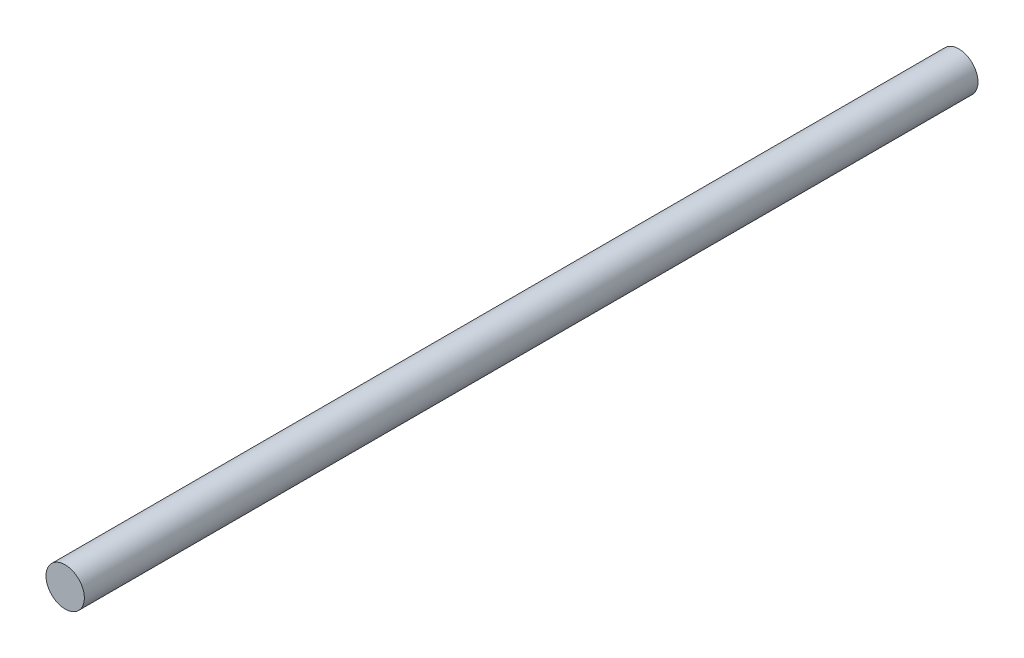
ISO-10303-21;
HEADER;
FILE_DESCRIPTION(('STEP AP214'),'2;1');
FILE_NAME('part.step','',(''),(''),'','','');
FILE_SCHEMA(('AUTOMOTIVE_DESIGN { 1 0 10303 214 1 1 1 1 }'));
ENDSEC;
DATA;
#1=APPLICATION_CONTEXT('core data for automotive mechanical design processes');
#2=APPLICATION_PROTOCOL_DEFINITION('international standard','automotive_design',2000,#1);
#3=PRODUCT_CONTEXT('',#1,'mechanical');
#4=PRODUCT('Part','Part','',(#3));
#5=PRODUCT_RELATED_PRODUCT_CATEGORY('part','',(#4));
#6=PRODUCT_DEFINITION_FORMATION('','',#4);
#7=PRODUCT_DEFINITION_CONTEXT('part definition',#1,'design');
#8=PRODUCT_DEFINITION('design','',#6,#7);
#9=PRODUCT_DEFINITION_SHAPE('','',#8);
#10=(LENGTH_UNIT() NAMED_UNIT(*) SI_UNIT(.MILLI.,.METRE.));
#11=(NAMED_UNIT(*) PLANE_ANGLE_UNIT() SI_UNIT($,.RADIAN.));
#12=(NAMED_UNIT(*) SI_UNIT($,.STERADIAN.) SOLID_ANGLE_UNIT());
#13=UNCERTAINTY_MEASURE_WITH_UNIT(LENGTH_MEASURE(1.E-05),#10,'distance_accuracy_value','');
#14=(GEOMETRIC_REPRESENTATION_CONTEXT(3) GLOBAL_UNCERTAINTY_ASSIGNED_CONTEXT((#13)) GLOBAL_UNIT_ASSIGNED_CONTEXT((#10,
#11,#12)) REPRESENTATION_CONTEXT('',''));
#15=CARTESIAN_POINT('',(0.,0.,0.));
#16=DIRECTION('',(0.,0.,1.));
#17=DIRECTION('',(1.,0.,0.));
#18=AXIS2_PLACEMENT_3D('',#15,#16,#17);
#19=CARTESIAN_POINT('',(0.,0.,500.5));
#20=DIRECTION('',(0.,0.,-1.));
#21=DIRECTION('',(-1.,0.,0.));
#22=AXIS2_PLACEMENT_3D('',#19,#20,#21);
#23=CYLINDRICAL_SURFACE('',#22,10.75);
#24=CARTESIAN_POINT('',(0.,0.,500.5));
#25=DIRECTION('',(0.,0.,1.));
#26=DIRECTION('',(1.,0.,0.));
#27=AXIS2_PLACEMENT_3D('',#24,#25,#26);
#28=CIRCLE('',#27,10.75);
#29=CARTESIAN_POINT('',(10.75,0.,500.5));
#30=VERTEX_POINT('',#29);
#31=EDGE_CURVE('E10',#30,#30,#28,.T.);
#32=ORIENTED_EDGE('',*,*,#31,.F.);
#33=EDGE_LOOP('',(#32));
#34=FACE_BOUND('',#33,.T.);
#35=CARTESIAN_POINT('',(0.,0.,0.));
#36=DIRECTION('',(0.,0.,1.));
#37=DIRECTION('',(1.,0.,0.));
#38=AXIS2_PLACEMENT_3D('',#35,#36,#37);
#39=CIRCLE('',#38,10.75);
#40=CARTESIAN_POINT('',(10.75,0.,0.));
#41=VERTEX_POINT('',#40);
#42=EDGE_CURVE('E35',#41,#41,#39,.T.);
#43=ORIENTED_EDGE('',*,*,#42,.T.);
#44=EDGE_LOOP('',(#43));
#45=FACE_BOUND('',#44,.T.);
#46=ADVANCED_FACE('F32',(#34,#45),#23,.T.);
#47=CARTESIAN_POINT('',(0.,0.,500.5));
#48=DIRECTION('',(0.,0.,1.));
#49=DIRECTION('',(1.,0.,0.));
#50=AXIS2_PLACEMENT_3D('',#47,#48,#49);
#51=PLANE('',#50);
#52=ORIENTED_EDGE('',*,*,#31,.T.);
#53=EDGE_LOOP('',(#52));
#54=FACE_BOUND('',#53,.T.);
#55=ADVANCED_FACE('F47',(#54),#51,.T.);
#56=CARTESIAN_POINT('',(0.,0.,0.));
#57=DIRECTION('',(0.,0.,1.));
#58=DIRECTION('',(1.,0.,0.));
#59=AXIS2_PLACEMENT_3D('',#56,#57,#58);
#60=PLANE('',#59);
#61=ORIENTED_EDGE('',*,*,#42,.F.);
#62=EDGE_LOOP('',(#61));
#63=FACE_BOUND('',#62,.T.);
#64=ADVANCED_FACE('F45',(#63),#60,.F.);
#65=CLOSED_SHELL('',(#46,#55,#64));
#66=MANIFOLD_SOLID_BREP('B2',#65);
#67=ADVANCED_BREP_SHAPE_REPRESENTATION('',(#18,#66),#14);
#68=SHAPE_DEFINITION_REPRESENTATION(#9,#67);
ENDSEC;
END-ISO-10303-21;
